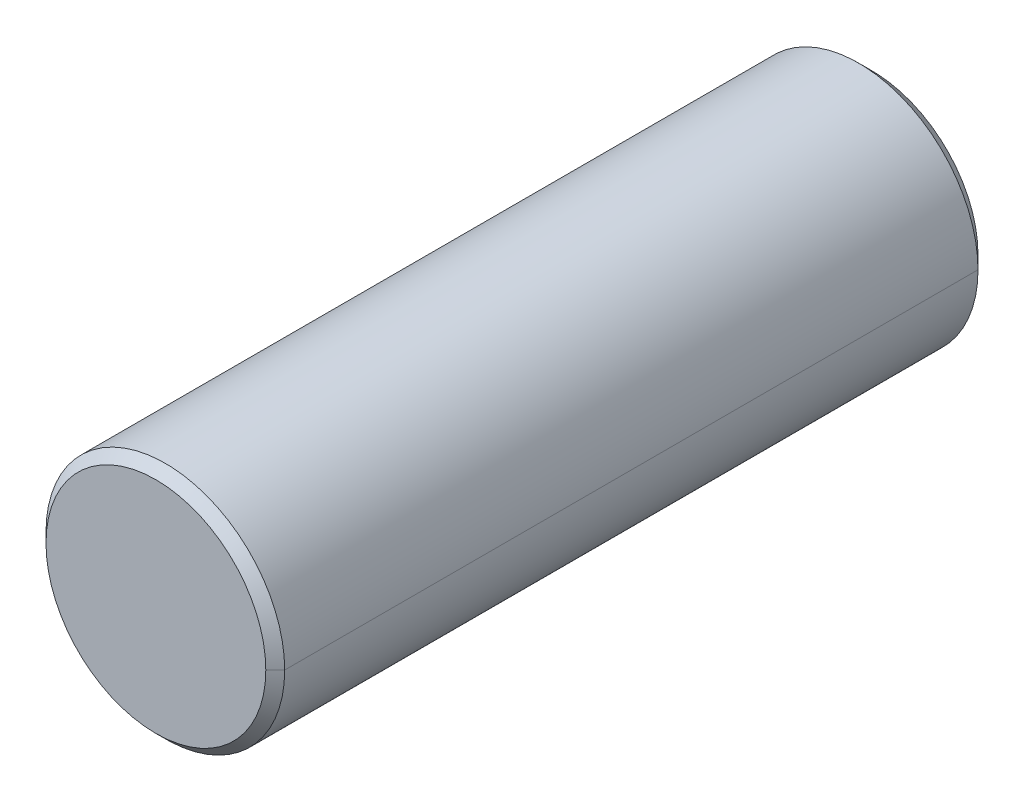
ISO-10303-21;
HEADER;
FILE_DESCRIPTION(('STEP AP214'),'2;1');
FILE_NAME('part.step','',(''),(''),'','','');
FILE_SCHEMA(('AUTOMOTIVE_DESIGN { 1 0 10303 214 1 1 1 1 }'));
ENDSEC;
DATA;
#1=APPLICATION_CONTEXT('core data for automotive mechanical design processes');
#2=APPLICATION_PROTOCOL_DEFINITION('international standard','automotive_design',2000,#1);
#3=PRODUCT_CONTEXT('',#1,'mechanical');
#4=PRODUCT('Part','Part','',(#3));
#5=PRODUCT_RELATED_PRODUCT_CATEGORY('part','',(#4));
#6=PRODUCT_DEFINITION_FORMATION('','',#4);
#7=PRODUCT_DEFINITION_CONTEXT('part definition',#1,'design');
#8=PRODUCT_DEFINITION('design','',#6,#7);
#9=PRODUCT_DEFINITION_SHAPE('','',#8);
#10=(LENGTH_UNIT() NAMED_UNIT(*) SI_UNIT(.MILLI.,.METRE.));
#11=(NAMED_UNIT(*) PLANE_ANGLE_UNIT() SI_UNIT($,.RADIAN.));
#12=(NAMED_UNIT(*) SI_UNIT($,.STERADIAN.) SOLID_ANGLE_UNIT());
#13=UNCERTAINTY_MEASURE_WITH_UNIT(LENGTH_MEASURE(1.E-05),#10,'distance_accuracy_value','');
#14=(GEOMETRIC_REPRESENTATION_CONTEXT(3) GLOBAL_UNCERTAINTY_ASSIGNED_CONTEXT((#13)) GLOBAL_UNIT_ASSIGNED_CONTEXT((#10,
#11,#12)) REPRESENTATION_CONTEXT('',''));
#15=CARTESIAN_POINT('',(0.,0.,0.));
#16=DIRECTION('',(0.,0.,1.));
#17=DIRECTION('',(1.,0.,0.));
#18=AXIS2_PLACEMENT_3D('',#15,#16,#17);
#19=CARTESIAN_POINT('',(0.,0.,-9.1694));
#20=DIRECTION('',(0.,0.,1.));
#21=DIRECTION('',(0.,-1.,0.));
#22=AXIS2_PLACEMENT_3D('',#19,#20,#21);
#23=CONICAL_SURFACE('',#22,3.175,0.7853981634);
#24=CARTESIAN_POINT('',(0.,0.,-9.525));
#25=DIRECTION('',(0.,0.,-1.));
#26=DIRECTION('',(-1.,0.,0.));
#27=AXIS2_PLACEMENT_3D('',#24,#25,#26);
#28=CIRCLE('',#27,2.8194);
#29=CARTESIAN_POINT('',(-2.8194,0.,-9.525));
#30=VERTEX_POINT('',#29);
#31=CARTESIAN_POINT('',(2.81939999999909,0.,-9.52499999999909));
#32=VERTEX_POINT('',#31);
#33=EDGE_CURVE('E11',#30,#32,#28,.T.);
#34=ORIENTED_EDGE('',*,*,#33,.F.);
#35=DIRECTION('',(-0.707106781188354,0.,0.707106781184741));
#36=VECTOR('',#35,1.);
#37=CARTESIAN_POINT('',(-2.81939999999909,0.,-9.52499999999909));
#38=LINE('',#37,#36);
#39=CARTESIAN_POINT('',(-3.175,0.,-9.1694));
#40=VERTEX_POINT('',#39);
#41=EDGE_CURVE('E25',#30,#40,#38,.T.);
#42=ORIENTED_EDGE('',*,*,#41,.T.);
#43=CARTESIAN_POINT('',(0.,0.,-9.1694));
#44=DIRECTION('',(0.,0.,-1.));
#45=DIRECTION('',(-1.,0.,0.));
#46=AXIS2_PLACEMENT_3D('',#43,#44,#45);
#47=CIRCLE('',#46,3.175);
#48=CARTESIAN_POINT('',(3.175,0.,-9.1694));
#49=VERTEX_POINT('',#48);
#50=EDGE_CURVE('E111',#40,#49,#47,.T.);
#51=ORIENTED_EDGE('',*,*,#50,.T.);
#52=DIRECTION('',(0.707106781188354,0.,0.707106781184741));
#53=VECTOR('',#52,1.);
#54=CARTESIAN_POINT('',(2.81939999999909,0.,-9.52499999999909));
#55=LINE('',#54,#53);
#56=EDGE_CURVE('E106',#32,#49,#55,.T.);
#57=ORIENTED_EDGE('',*,*,#56,.F.);
#58=EDGE_LOOP('',(#34,#42,#51,#57));
#59=FACE_BOUND('',#58,.T.);
#60=ADVANCED_FACE('F17',(#59),#23,.T.);
#61=CARTESIAN_POINT('',(0.,0.,-9.1694));
#62=DIRECTION('',(0.,0.,1.));
#63=DIRECTION('',(0.,1.,0.));
#64=AXIS2_PLACEMENT_3D('',#61,#62,#63);
#65=CONICAL_SURFACE('',#64,3.175,0.7853981634);
#66=CARTESIAN_POINT('',(0.,0.,-9.1694));
#67=DIRECTION('',(0.,0.,-1.));
#68=DIRECTION('',(-1.,0.,0.));
#69=AXIS2_PLACEMENT_3D('',#66,#67,#68);
#70=CIRCLE('',#69,3.175);
#71=EDGE_CURVE('E102',#49,#40,#70,.T.);
#72=ORIENTED_EDGE('',*,*,#71,.T.);
#73=ORIENTED_EDGE('',*,*,#41,.F.);
#74=CARTESIAN_POINT('',(0.,0.,-9.525));
#75=DIRECTION('',(0.,0.,-1.));
#76=DIRECTION('',(-1.,0.,0.));
#77=AXIS2_PLACEMENT_3D('',#74,#75,#76);
#78=CIRCLE('',#77,2.8194);
#79=EDGE_CURVE('E97',#32,#30,#78,.T.);
#80=ORIENTED_EDGE('',*,*,#79,.F.);
#81=ORIENTED_EDGE('',*,*,#56,.T.);
#82=EDGE_LOOP('',(#72,#73,#80,#81));
#83=FACE_BOUND('',#82,.T.);
#84=ADVANCED_FACE('F125',(#83),#65,.T.);
#85=CARTESIAN_POINT('',(0.,2.8194,-9.525));
#86=DIRECTION('',(0.,0.,1.));
#87=DIRECTION('',(1.,0.,0.));
#88=AXIS2_PLACEMENT_3D('',#85,#86,#87);
#89=PLANE('',#88);
#90=ORIENTED_EDGE('',*,*,#33,.T.);
#91=ORIENTED_EDGE('',*,*,#79,.T.);
#92=EDGE_LOOP('',(#90,#91));
#93=FACE_BOUND('',#92,.T.);
#94=ADVANCED_FACE('F138',(#93),#89,.F.);
#95=CARTESIAN_POINT('',(0.,0.,-9.525));
#96=DIRECTION('',(0.,0.,1.));
#97=DIRECTION('',(0.,1.,0.));
#98=AXIS2_PLACEMENT_3D('',#95,#96,#97);
#99=CYLINDRICAL_SURFACE('',#98,3.175);
#100=CARTESIAN_POINT('',(0.,0.,9.27355282861011));
#101=DIRECTION('',(0.,0.,-1.));
#102=DIRECTION('',(-1.,0.,0.));
#103=AXIS2_PLACEMENT_3D('',#100,#101,#102);
#104=CIRCLE('',#103,3.175);
#105=CARTESIAN_POINT('',(3.175,0.,9.27355282861011));
#106=VERTEX_POINT('',#105);
#107=CARTESIAN_POINT('',(-3.175,0.,9.27355282861011));
#108=VERTEX_POINT('',#107);
#109=EDGE_CURVE('E68',#106,#108,#104,.T.);
#110=ORIENTED_EDGE('',*,*,#109,.T.);
#111=DIRECTION('',(0.,0.,1.));
#112=VECTOR('',#111,1.);
#113=CARTESIAN_POINT('',(-3.175,0.,-9.1694));
#114=LINE('',#113,#112);
#115=EDGE_CURVE('E89',#40,#108,#114,.T.);
#116=ORIENTED_EDGE('',*,*,#115,.F.);
#117=ORIENTED_EDGE('',*,*,#71,.F.);
#118=DIRECTION('',(0.,0.,1.));
#119=VECTOR('',#118,1.);
#120=CARTESIAN_POINT('',(3.175,0.,-9.1694));
#121=LINE('',#120,#119);
#122=EDGE_CURVE('E85',#49,#106,#121,.T.);
#123=ORIENTED_EDGE('',*,*,#122,.T.);
#124=EDGE_LOOP('',(#110,#116,#117,#123));
#125=FACE_BOUND('',#124,.T.);
#126=ADVANCED_FACE('F128',(#125),#99,.T.);
#127=CARTESIAN_POINT('',(0.,0.,-9.525));
#128=DIRECTION('',(0.,0.,1.));
#129=DIRECTION('',(0.,-1.,0.));
#130=AXIS2_PLACEMENT_3D('',#127,#128,#129);
#131=CYLINDRICAL_SURFACE('',#130,3.175);
#132=ORIENTED_EDGE('',*,*,#50,.F.);
#133=ORIENTED_EDGE('',*,*,#115,.T.);
#134=CARTESIAN_POINT('',(0.,0.,9.27355282861011));
#135=DIRECTION('',(0.,0.,-1.));
#136=DIRECTION('',(-1.,0.,0.));
#137=AXIS2_PLACEMENT_3D('',#134,#135,#136);
#138=CIRCLE('',#137,3.175);
#139=EDGE_CURVE('E80',#108,#106,#138,.T.);
#140=ORIENTED_EDGE('',*,*,#139,.T.);
#141=ORIENTED_EDGE('',*,*,#122,.F.);
#142=EDGE_LOOP('',(#132,#133,#140,#141));
#143=FACE_BOUND('',#142,.T.);
#144=ADVANCED_FACE('F129',(#143),#131,.T.);
#145=CARTESIAN_POINT('',(0.,0.,9.525));
#146=DIRECTION('',(0.,0.,-1.));
#147=DIRECTION('',(0.,-1.,0.));
#148=AXIS2_PLACEMENT_3D('',#145,#146,#147);
#149=CONICAL_SURFACE('',#148,2.92355282954,0.7853981634);
#150=ORIENTED_EDGE('',*,*,#139,.F.);
#151=DIRECTION('',(-0.707106781188352,0.,-0.707106781184743));
#152=VECTOR('',#151,1.);
#153=CARTESIAN_POINT('',(-2.92355282954,0.,9.525));
#154=LINE('',#153,#152);
#155=CARTESIAN_POINT('',(-2.92355282861011,0.,9.525));
#156=VERTEX_POINT('',#155);
#157=EDGE_CURVE('E60',#156,#108,#154,.T.);
#158=ORIENTED_EDGE('',*,*,#157,.F.);
#159=CARTESIAN_POINT('',(0.,0.,9.525));
#160=DIRECTION('',(0.,0.,-1.));
#161=DIRECTION('',(-1.,0.,0.));
#162=AXIS2_PLACEMENT_3D('',#159,#160,#161);
#163=CIRCLE('',#162,2.92355282954);
#164=CARTESIAN_POINT('',(2.92355282954,0.,9.525));
#165=VERTEX_POINT('',#164);
#166=EDGE_CURVE('E53',#156,#165,#163,.T.);
#167=ORIENTED_EDGE('',*,*,#166,.T.);
#168=DIRECTION('',(0.707106781188352,0.,-0.707106781184743));
#169=VECTOR('',#168,1.);
#170=CARTESIAN_POINT('',(2.92355282954,0.,9.525));
#171=LINE('',#170,#169);
#172=EDGE_CURVE('E57',#165,#106,#171,.T.);
#173=ORIENTED_EDGE('',*,*,#172,.T.);
#174=EDGE_LOOP('',(#150,#158,#167,#173));
#175=FACE_BOUND('',#174,.T.);
#176=ADVANCED_FACE('F56',(#175),#149,.T.);
#177=CARTESIAN_POINT('',(0.,0.,9.525));
#178=DIRECTION('',(0.,0.,-1.));
#179=DIRECTION('',(0.,1.,0.));
#180=AXIS2_PLACEMENT_3D('',#177,#178,#179);
#181=CONICAL_SURFACE('',#180,2.92355282954,0.7853981634);
#182=CARTESIAN_POINT('',(0.,0.,9.525));
#183=DIRECTION('',(0.,0.,-1.));
#184=DIRECTION('',(-1.,0.,0.));
#185=AXIS2_PLACEMENT_3D('',#182,#183,#184);
#186=CIRCLE('',#185,2.92355282954);
#187=EDGE_CURVE('E67',#165,#156,#186,.T.);
#188=ORIENTED_EDGE('',*,*,#187,.T.);
#189=ORIENTED_EDGE('',*,*,#157,.T.);
#190=ORIENTED_EDGE('',*,*,#109,.F.);
#191=ORIENTED_EDGE('',*,*,#172,.F.);
#192=EDGE_LOOP('',(#188,#189,#190,#191));
#193=FACE_BOUND('',#192,.T.);
#194=ADVANCED_FACE('F66',(#193),#181,.T.);
#195=CARTESIAN_POINT('',(0.,0.,9.525));
#196=DIRECTION('',(0.,0.,-1.));
#197=DIRECTION('',(-1.,0.,0.));
#198=AXIS2_PLACEMENT_3D('',#195,#196,#197);
#199=PLANE('',#198);
#200=ORIENTED_EDGE('',*,*,#166,.F.);
#201=ORIENTED_EDGE('',*,*,#187,.F.);
#202=EDGE_LOOP('',(#200,#201));
#203=FACE_BOUND('',#202,.T.);
#204=ADVANCED_FACE('F70',(#203),#199,.F.);
#205=CLOSED_SHELL('',(#60,#84,#94,#126,#144,#176,#194,#204));
#206=MANIFOLD_SOLID_BREP('B1',#205);
#207=ADVANCED_BREP_SHAPE_REPRESENTATION('',(#18,#206),#14);
#208=SHAPE_DEFINITION_REPRESENTATION(#9,#207);
ENDSEC;
END-ISO-10303-21;
